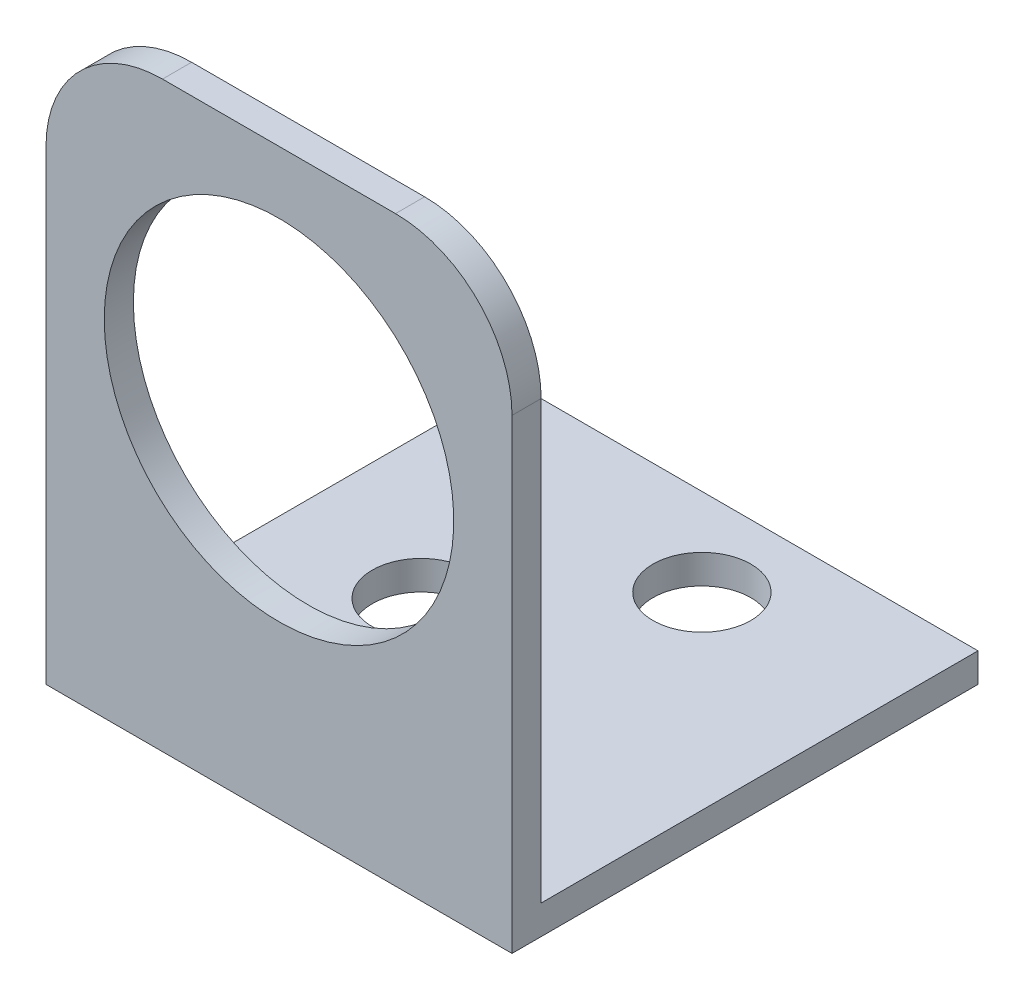
ISO-10303-21;
HEADER;
FILE_DESCRIPTION(('STEP AP214'),'2;1');
FILE_NAME('part.step','',(''),(''),'','','');
FILE_SCHEMA(('AUTOMOTIVE_DESIGN { 1 0 10303 214 1 1 1 1 }'));
ENDSEC;
DATA;
#1=APPLICATION_CONTEXT('core data for automotive mechanical design processes');
#2=APPLICATION_PROTOCOL_DEFINITION('international standard','automotive_design',2000,#1);
#3=PRODUCT_CONTEXT('',#1,'mechanical');
#4=PRODUCT('Part','Part','',(#3));
#5=PRODUCT_RELATED_PRODUCT_CATEGORY('part','',(#4));
#6=PRODUCT_DEFINITION_FORMATION('','',#4);
#7=PRODUCT_DEFINITION_CONTEXT('part definition',#1,'design');
#8=PRODUCT_DEFINITION('design','',#6,#7);
#9=PRODUCT_DEFINITION_SHAPE('','',#8);
#10=(LENGTH_UNIT() NAMED_UNIT(*) SI_UNIT(.MILLI.,.METRE.));
#11=(NAMED_UNIT(*) PLANE_ANGLE_UNIT() SI_UNIT($,.RADIAN.));
#12=(NAMED_UNIT(*) SI_UNIT($,.STERADIAN.) SOLID_ANGLE_UNIT());
#13=UNCERTAINTY_MEASURE_WITH_UNIT(LENGTH_MEASURE(1.E-05),#10,'distance_accuracy_value','');
#14=(GEOMETRIC_REPRESENTATION_CONTEXT(3) GLOBAL_UNCERTAINTY_ASSIGNED_CONTEXT((#13)) GLOBAL_UNIT_ASSIGNED_CONTEXT((#10,
#11,#12)) REPRESENTATION_CONTEXT('',''));
#15=CARTESIAN_POINT('',(0.,0.,0.));
#16=DIRECTION('',(0.,0.,1.));
#17=DIRECTION('',(1.,0.,0.));
#18=AXIS2_PLACEMENT_3D('',#15,#16,#17);
#19=CARTESIAN_POINT('',(25.4,0.,0.));
#20=DIRECTION('',(0.,0.,-1.));
#21=DIRECTION('',(-1.,0.,0.));
#22=AXIS2_PLACEMENT_3D('',#19,#20,#21);
#23=PLANE('',#22);
#24=CARTESIAN_POINT('',(12.7,18.8307473564399,0.));
#25=DIRECTION('',(0.,0.,-1.));
#26=DIRECTION('',(-1.,0.,0.));
#27=AXIS2_PLACEMENT_3D('',#24,#25,#26);
#28=CIRCLE('',#27,9.525);
#29=CARTESIAN_POINT('',(3.175,18.8307473564399,0.));
#30=VERTEX_POINT('',#29);
#31=EDGE_CURVE('E177',#30,#30,#28,.F.);
#32=ORIENTED_EDGE('',*,*,#31,.F.);
#33=EDGE_LOOP('',(#32));
#34=FACE_BOUND('',#33,.T.);
#35=DIRECTION('',(0.,-1.,0.));
#36=VECTOR('',#35,1.);
#37=CARTESIAN_POINT('',(25.4,0.,0.));
#38=LINE('',#37,#36);
#39=CARTESIAN_POINT('',(25.4,25.4,0.));
#40=VERTEX_POINT('',#39);
#41=CARTESIAN_POINT('',(25.4,0.,0.));
#42=VERTEX_POINT('',#41);
#43=EDGE_CURVE('E100',#40,#42,#38,.T.);
#44=ORIENTED_EDGE('',*,*,#43,.F.);
#45=CARTESIAN_POINT('',(19.05,25.4,0.));
#46=DIRECTION('',(0.,0.,-1.));
#47=DIRECTION('',(-1.,0.,0.));
#48=AXIS2_PLACEMENT_3D('',#45,#46,#47);
#49=CIRCLE('',#48,6.35);
#50=CARTESIAN_POINT('',(19.05,31.75,0.));
#51=VERTEX_POINT('',#50);
#52=EDGE_CURVE('E131',#40,#51,#49,.F.);
#53=ORIENTED_EDGE('',*,*,#52,.T.);
#54=DIRECTION('',(-1.,0.,0.));
#55=VECTOR('',#54,1.);
#56=CARTESIAN_POINT('',(25.4,31.75,0.));
#57=LINE('',#56,#55);
#58=CARTESIAN_POINT('',(6.35,31.75,0.));
#59=VERTEX_POINT('',#58);
#60=EDGE_CURVE('E149',#51,#59,#57,.T.);
#61=ORIENTED_EDGE('',*,*,#60,.T.);
#62=CARTESIAN_POINT('',(6.35,25.4,0.));
#63=DIRECTION('',(0.,0.,-1.));
#64=DIRECTION('',(-1.,0.,0.));
#65=AXIS2_PLACEMENT_3D('',#62,#63,#64);
#66=CIRCLE('',#65,6.35);
#67=CARTESIAN_POINT('',(0.,25.4,0.));
#68=VERTEX_POINT('',#67);
#69=EDGE_CURVE('E124',#59,#68,#66,.F.);
#70=ORIENTED_EDGE('',*,*,#69,.T.);
#71=DIRECTION('',(0.,-1.,0.));
#72=VECTOR('',#71,1.);
#73=CARTESIAN_POINT('',(0.,0.,0.));
#74=LINE('',#73,#72);
#75=CARTESIAN_POINT('',(0.,0.,0.));
#76=VERTEX_POINT('',#75);
#77=EDGE_CURVE('E121',#68,#76,#74,.T.);
#78=ORIENTED_EDGE('',*,*,#77,.T.);
#79=DIRECTION('',(-1.,0.,0.));
#80=VECTOR('',#79,1.);
#81=CARTESIAN_POINT('',(25.4,0.,0.));
#82=LINE('',#81,#80);
#83=EDGE_CURVE('E115',#42,#76,#82,.T.);
#84=ORIENTED_EDGE('',*,*,#83,.F.);
#85=EDGE_LOOP('',(#44,#53,#61,#70,#78,#84));
#86=FACE_BOUND('',#85,.T.);
#87=ADVANCED_FACE('F34',(#34,#86),#23,.F.);
#88=CARTESIAN_POINT('',(25.4,0.,0.));
#89=DIRECTION('',(0.,1.,0.));
#90=DIRECTION('',(0.,0.,1.));
#91=AXIS2_PLACEMENT_3D('',#88,#89,#90);
#92=PLANE('',#91);
#93=CARTESIAN_POINT('',(15.1130000000052,0.,-20.6375));
#94=DIRECTION('',(0.,-1.,0.));
#95=DIRECTION('',(0.,0.,-1.));
#96=AXIS2_PLACEMENT_3D('',#93,#94,#95);
#97=CIRCLE('',#96,2.667);
#98=CARTESIAN_POINT('',(15.1130000000052,0.,-23.3045));
#99=VERTEX_POINT('',#98);
#100=EDGE_CURVE('E190',#99,#99,#97,.T.);
#101=ORIENTED_EDGE('',*,*,#100,.F.);
#102=EDGE_LOOP('',(#101));
#103=FACE_BOUND('',#102,.T.);
#104=CARTESIAN_POINT('',(7.74700000000395,0.,-12.7));
#105=DIRECTION('',(0.,-1.,0.));
#106=DIRECTION('',(0.,0.,-1.));
#107=AXIS2_PLACEMENT_3D('',#104,#105,#106);
#108=CIRCLE('',#107,2.667);
#109=CARTESIAN_POINT('',(7.74700000000395,0.,-15.367));
#110=VERTEX_POINT('',#109);
#111=EDGE_CURVE('E191',#110,#110,#108,.T.);
#112=ORIENTED_EDGE('',*,*,#111,.F.);
#113=EDGE_LOOP('',(#112));
#114=FACE_BOUND('',#113,.T.);
#115=DIRECTION('',(0.,0.,-1.));
#116=VECTOR('',#115,1.);
#117=CARTESIAN_POINT('',(0.,0.,0.));
#118=LINE('',#117,#116);
#119=CARTESIAN_POINT('',(0.,0.,-25.4));
#120=VERTEX_POINT('',#119);
#121=EDGE_CURVE('E173',#76,#120,#118,.T.);
#122=ORIENTED_EDGE('',*,*,#121,.T.);
#123=DIRECTION('',(-1.,0.,0.));
#124=VECTOR('',#123,1.);
#125=CARTESIAN_POINT('',(25.4,0.,-25.4));
#126=LINE('',#125,#124);
#127=CARTESIAN_POINT('',(25.4,0.,-25.4));
#128=VERTEX_POINT('',#127);
#129=EDGE_CURVE('E117',#128,#120,#126,.T.);
#130=ORIENTED_EDGE('',*,*,#129,.F.);
#131=DIRECTION('',(0.,0.,-1.));
#132=VECTOR('',#131,1.);
#133=CARTESIAN_POINT('',(25.4,0.,0.));
#134=LINE('',#133,#132);
#135=EDGE_CURVE('E104',#42,#128,#134,.T.);
#136=ORIENTED_EDGE('',*,*,#135,.F.);
#137=ORIENTED_EDGE('',*,*,#83,.T.);
#138=EDGE_LOOP('',(#122,#130,#136,#137));
#139=FACE_BOUND('',#138,.T.);
#140=ADVANCED_FACE('F114',(#103,#114,#139),#92,.F.);
#141=CARTESIAN_POINT('',(25.4,0.,-25.4));
#142=DIRECTION('',(0.,0.,1.));
#143=DIRECTION('',(1.,0.,0.));
#144=AXIS2_PLACEMENT_3D('',#141,#142,#143);
#145=PLANE('',#144);
#146=DIRECTION('',(0.,1.,0.));
#147=VECTOR('',#146,1.);
#148=CARTESIAN_POINT('',(0.,0.,-25.4));
#149=LINE('',#148,#147);
#150=CARTESIAN_POINT('',(0.,1.5875,-25.4));
#151=VERTEX_POINT('',#150);
#152=EDGE_CURVE('E172',#120,#151,#149,.T.);
#153=ORIENTED_EDGE('',*,*,#152,.T.);
#154=DIRECTION('',(-1.,0.,0.));
#155=VECTOR('',#154,1.);
#156=CARTESIAN_POINT('',(25.4,1.5875,-25.4));
#157=LINE('',#156,#155);
#158=CARTESIAN_POINT('',(25.4,1.5875,-25.4));
#159=VERTEX_POINT('',#158);
#160=EDGE_CURVE('E126',#159,#151,#157,.T.);
#161=ORIENTED_EDGE('',*,*,#160,.F.);
#162=DIRECTION('',(0.,1.,0.));
#163=VECTOR('',#162,1.);
#164=CARTESIAN_POINT('',(25.4,0.,-25.4));
#165=LINE('',#164,#163);
#166=EDGE_CURVE('E119',#128,#159,#165,.T.);
#167=ORIENTED_EDGE('',*,*,#166,.F.);
#168=ORIENTED_EDGE('',*,*,#129,.T.);
#169=EDGE_LOOP('',(#153,#161,#167,#168));
#170=FACE_BOUND('',#169,.T.);
#171=ADVANCED_FACE('F204',(#170),#145,.F.);
#172=CARTESIAN_POINT('',(25.4,1.5875,-1.5875));
#173=DIRECTION('',(0.,-1.,0.));
#174=DIRECTION('',(0.,0.,-1.));
#175=AXIS2_PLACEMENT_3D('',#172,#173,#174);
#176=PLANE('',#175);
#177=CARTESIAN_POINT('',(15.1130000000052,1.5875,-20.6375));
#178=DIRECTION('',(0.,-1.,0.));
#179=DIRECTION('',(0.,0.,-1.));
#180=AXIS2_PLACEMENT_3D('',#177,#178,#179);
#181=CIRCLE('',#180,2.667);
#182=CARTESIAN_POINT('',(15.1130000000052,1.5875,-23.3045));
#183=VERTEX_POINT('',#182);
#184=EDGE_CURVE('E186',#183,#183,#181,.F.);
#185=ORIENTED_EDGE('',*,*,#184,.F.);
#186=EDGE_LOOP('',(#185));
#187=FACE_BOUND('',#186,.T.);
#188=CARTESIAN_POINT('',(7.74700000000395,1.5875,-12.7));
#189=DIRECTION('',(0.,-1.,0.));
#190=DIRECTION('',(0.,0.,-1.));
#191=AXIS2_PLACEMENT_3D('',#188,#189,#190);
#192=CIRCLE('',#191,2.667);
#193=CARTESIAN_POINT('',(7.74700000000395,1.5875,-15.367));
#194=VERTEX_POINT('',#193);
#195=EDGE_CURVE('E187',#194,#194,#192,.F.);
#196=ORIENTED_EDGE('',*,*,#195,.F.);
#197=EDGE_LOOP('',(#196));
#198=FACE_BOUND('',#197,.T.);
#199=DIRECTION('',(0.,0.,1.));
#200=VECTOR('',#199,1.);
#201=CARTESIAN_POINT('',(0.,1.5875,-1.5875));
#202=LINE('',#201,#200);
#203=CARTESIAN_POINT('',(0.,1.5875,-1.5875));
#204=VERTEX_POINT('',#203);
#205=EDGE_CURVE('E168',#151,#204,#202,.T.);
#206=ORIENTED_EDGE('',*,*,#205,.T.);
#207=DIRECTION('',(-1.,0.,0.));
#208=VECTOR('',#207,1.);
#209=CARTESIAN_POINT('',(25.4,1.5875,-1.5875));
#210=LINE('',#209,#208);
#211=CARTESIAN_POINT('',(25.4,1.5875,-1.5875));
#212=VERTEX_POINT('',#211);
#213=EDGE_CURVE('E158',#212,#204,#210,.T.);
#214=ORIENTED_EDGE('',*,*,#213,.F.);
#215=DIRECTION('',(0.,0.,1.));
#216=VECTOR('',#215,1.);
#217=CARTESIAN_POINT('',(25.4,1.5875,-1.5875));
#218=LINE('',#217,#216);
#219=EDGE_CURVE('E147',#159,#212,#218,.T.);
#220=ORIENTED_EDGE('',*,*,#219,.F.);
#221=ORIENTED_EDGE('',*,*,#160,.T.);
#222=EDGE_LOOP('',(#206,#214,#220,#221));
#223=FACE_BOUND('',#222,.T.);
#224=ADVANCED_FACE('F167',(#187,#198,#223),#176,.F.);
#225=CARTESIAN_POINT('',(25.4,1.5875,-1.5875));
#226=DIRECTION('',(0.,0.,1.));
#227=DIRECTION('',(1.,0.,0.));
#228=AXIS2_PLACEMENT_3D('',#225,#226,#227);
#229=PLANE('',#228);
#230=CARTESIAN_POINT('',(12.7,18.8307473564399,-1.5875));
#231=DIRECTION('',(0.,0.,-1.));
#232=DIRECTION('',(-1.,0.,0.));
#233=AXIS2_PLACEMENT_3D('',#230,#231,#232);
#234=CIRCLE('',#233,9.525);
#235=CARTESIAN_POINT('',(3.175,18.8307473564399,-1.5875));
#236=VERTEX_POINT('',#235);
#237=EDGE_CURVE('E183',#236,#236,#234,.T.);
#238=ORIENTED_EDGE('',*,*,#237,.F.);
#239=EDGE_LOOP('',(#238));
#240=FACE_BOUND('',#239,.T.);
#241=DIRECTION('',(-1.,0.,0.));
#242=VECTOR('',#241,1.);
#243=CARTESIAN_POINT('',(25.4,31.75,-1.5875));
#244=LINE('',#243,#242);
#245=CARTESIAN_POINT('',(19.05,31.75,-1.5875));
#246=VERTEX_POINT('',#245);
#247=CARTESIAN_POINT('',(6.35,31.75,-1.5875));
#248=VERTEX_POINT('',#247);
#249=EDGE_CURVE('E143',#246,#248,#244,.T.);
#250=ORIENTED_EDGE('',*,*,#249,.F.);
#251=CARTESIAN_POINT('',(19.05,25.4,-1.5875));
#252=DIRECTION('',(0.,0.,1.));
#253=DIRECTION('',(1.,0.,0.));
#254=AXIS2_PLACEMENT_3D('',#251,#252,#253);
#255=CIRCLE('',#254,6.35);
#256=CARTESIAN_POINT('',(25.4,25.4,-1.5875));
#257=VERTEX_POINT('',#256);
#258=EDGE_CURVE('E42',#246,#257,#255,.F.);
#259=ORIENTED_EDGE('',*,*,#258,.T.);
#260=DIRECTION('',(0.,1.,0.));
#261=VECTOR('',#260,1.);
#262=CARTESIAN_POINT('',(25.4,1.5875,-1.5875));
#263=LINE('',#262,#261);
#264=EDGE_CURVE('E142',#212,#257,#263,.T.);
#265=ORIENTED_EDGE('',*,*,#264,.F.);
#266=ORIENTED_EDGE('',*,*,#213,.T.);
#267=DIRECTION('',(0.,1.,0.));
#268=VECTOR('',#267,1.);
#269=CARTESIAN_POINT('',(0.,1.5875,-1.5875));
#270=LINE('',#269,#268);
#271=CARTESIAN_POINT('',(0.,25.4,-1.5875));
#272=VERTEX_POINT('',#271);
#273=EDGE_CURVE('E110',#204,#272,#270,.T.);
#274=ORIENTED_EDGE('',*,*,#273,.T.);
#275=CARTESIAN_POINT('',(6.35,25.4,-1.5875));
#276=DIRECTION('',(0.,0.,1.));
#277=DIRECTION('',(1.,0.,0.));
#278=AXIS2_PLACEMENT_3D('',#275,#276,#277);
#279=CIRCLE('',#278,6.35);
#280=EDGE_CURVE('E54',#272,#248,#279,.F.);
#281=ORIENTED_EDGE('',*,*,#280,.T.);
#282=EDGE_LOOP('',(#250,#259,#265,#266,#274,#281));
#283=FACE_BOUND('',#282,.T.);
#284=ADVANCED_FACE('F140',(#240,#283),#229,.F.);
#285=CARTESIAN_POINT('',(25.4,31.75,0.));
#286=DIRECTION('',(0.,-1.,0.));
#287=DIRECTION('',(0.,0.,-1.));
#288=AXIS2_PLACEMENT_3D('',#285,#286,#287);
#289=PLANE('',#288);
#290=ORIENTED_EDGE('',*,*,#60,.F.);
#291=DIRECTION('',(0.,0.,1.));
#292=VECTOR('',#291,1.);
#293=CARTESIAN_POINT('',(19.05,31.75,0.));
#294=LINE('',#293,#292);
#295=EDGE_CURVE('E136',#51,#246,#294,.F.);
#296=ORIENTED_EDGE('',*,*,#295,.T.);
#297=ORIENTED_EDGE('',*,*,#249,.T.);
#298=DIRECTION('',(0.,0.,1.));
#299=VECTOR('',#298,1.);
#300=CARTESIAN_POINT('',(6.35,31.75,0.));
#301=LINE('',#300,#299);
#302=EDGE_CURVE('E133',#248,#59,#301,.T.);
#303=ORIENTED_EDGE('',*,*,#302,.T.);
#304=EDGE_LOOP('',(#290,#296,#297,#303));
#305=FACE_BOUND('',#304,.T.);
#306=ADVANCED_FACE('F155',(#305),#289,.F.);
#307=CARTESIAN_POINT('',(25.4,0.,0.));
#308=DIRECTION('',(-1.,0.,0.));
#309=DIRECTION('',(0.,0.,1.));
#310=AXIS2_PLACEMENT_3D('',#307,#308,#309);
#311=PLANE('',#310);
#312=ORIENTED_EDGE('',*,*,#264,.T.);
#313=DIRECTION('',(0.,0.,1.));
#314=VECTOR('',#313,1.);
#315=CARTESIAN_POINT('',(25.4,25.4,0.));
#316=LINE('',#315,#314);
#317=EDGE_CURVE('E107',#257,#40,#316,.T.);
#318=ORIENTED_EDGE('',*,*,#317,.T.);
#319=ORIENTED_EDGE('',*,*,#43,.T.);
#320=ORIENTED_EDGE('',*,*,#135,.T.);
#321=ORIENTED_EDGE('',*,*,#166,.T.);
#322=ORIENTED_EDGE('',*,*,#219,.T.);
#323=EDGE_LOOP('',(#312,#318,#319,#320,#321,#322));
#324=FACE_BOUND('',#323,.T.);
#325=ADVANCED_FACE('F103',(#324),#311,.F.);
#326=CARTESIAN_POINT('',(0.,0.,0.));
#327=DIRECTION('',(-1.,0.,0.));
#328=DIRECTION('',(0.,0.,1.));
#329=AXIS2_PLACEMENT_3D('',#326,#327,#328);
#330=PLANE('',#329);
#331=ORIENTED_EDGE('',*,*,#77,.F.);
#332=DIRECTION('',(0.,0.,1.));
#333=VECTOR('',#332,1.);
#334=CARTESIAN_POINT('',(0.,25.4,-1.5875));
#335=LINE('',#334,#333);
#336=EDGE_CURVE('E11',#68,#272,#335,.F.);
#337=ORIENTED_EDGE('',*,*,#336,.T.);
#338=ORIENTED_EDGE('',*,*,#273,.F.);
#339=ORIENTED_EDGE('',*,*,#205,.F.);
#340=ORIENTED_EDGE('',*,*,#152,.F.);
#341=ORIENTED_EDGE('',*,*,#121,.F.);
#342=EDGE_LOOP('',(#331,#337,#338,#339,#340,#341));
#343=FACE_BOUND('',#342,.T.);
#344=ADVANCED_FACE('F171',(#343),#330,.T.);
#345=CARTESIAN_POINT('',(12.7,18.8307473564399,0.000999999999999916));
#346=DIRECTION('',(0.,0.,-1.));
#347=DIRECTION('',(-1.,0.,0.));
#348=AXIS2_PLACEMENT_3D('',#345,#346,#347);
#349=CYLINDRICAL_SURFACE('',#348,9.525);
#350=ORIENTED_EDGE('',*,*,#237,.T.);
#351=EDGE_LOOP('',(#350));
#352=FACE_BOUND('',#351,.T.);
#353=ORIENTED_EDGE('',*,*,#31,.T.);
#354=EDGE_LOOP('',(#353));
#355=FACE_BOUND('',#354,.T.);
#356=ADVANCED_FACE('F232',(#352,#355),#349,.F.);
#357=CARTESIAN_POINT('',(19.05,25.4,0.));
#358=DIRECTION('',(0.,0.,1.));
#359=DIRECTION('',(1.,0.,0.));
#360=AXIS2_PLACEMENT_3D('',#357,#358,#359);
#361=CYLINDRICAL_SURFACE('',#360,6.35);
#362=ORIENTED_EDGE('',*,*,#258,.F.);
#363=ORIENTED_EDGE('',*,*,#295,.F.);
#364=ORIENTED_EDGE('',*,*,#52,.F.);
#365=ORIENTED_EDGE('',*,*,#317,.F.);
#366=EDGE_LOOP('',(#362,#363,#364,#365));
#367=FACE_BOUND('',#366,.T.);
#368=ADVANCED_FACE('F151',(#367),#361,.T.);
#369=CARTESIAN_POINT('',(6.35,25.4,0.));
#370=DIRECTION('',(0.,0.,-1.));
#371=DIRECTION('',(-1.,0.,0.));
#372=AXIS2_PLACEMENT_3D('',#369,#370,#371);
#373=CYLINDRICAL_SURFACE('',#372,6.35);
#374=ORIENTED_EDGE('',*,*,#280,.F.);
#375=ORIENTED_EDGE('',*,*,#336,.F.);
#376=ORIENTED_EDGE('',*,*,#69,.F.);
#377=ORIENTED_EDGE('',*,*,#302,.F.);
#378=EDGE_LOOP('',(#374,#375,#376,#377));
#379=FACE_BOUND('',#378,.T.);
#380=ADVANCED_FACE('F36',(#379),#373,.T.);
#381=CARTESIAN_POINT('',(7.74700000000395,31.751,-12.7));
#382=DIRECTION('',(0.,-1.,0.));
#383=DIRECTION('',(0.,0.,-1.));
#384=AXIS2_PLACEMENT_3D('',#381,#382,#383);
#385=CYLINDRICAL_SURFACE('',#384,2.667);
#386=ORIENTED_EDGE('',*,*,#111,.T.);
#387=EDGE_LOOP('',(#386));
#388=FACE_BOUND('',#387,.T.);
#389=ORIENTED_EDGE('',*,*,#195,.T.);
#390=EDGE_LOOP('',(#389));
#391=FACE_BOUND('',#390,.T.);
#392=ADVANCED_FACE('F208',(#388,#391),#385,.F.);
#393=CARTESIAN_POINT('',(15.1130000000052,31.751,-20.6375));
#394=DIRECTION('',(0.,-1.,0.));
#395=DIRECTION('',(0.,0.,-1.));
#396=AXIS2_PLACEMENT_3D('',#393,#394,#395);
#397=CYLINDRICAL_SURFACE('',#396,2.667);
#398=ORIENTED_EDGE('',*,*,#100,.T.);
#399=EDGE_LOOP('',(#398));
#400=FACE_BOUND('',#399,.T.);
#401=ORIENTED_EDGE('',*,*,#184,.T.);
#402=EDGE_LOOP('',(#401));
#403=FACE_BOUND('',#402,.T.);
#404=ADVANCED_FACE('F199',(#400,#403),#397,.F.);
#405=CLOSED_SHELL('',(#87,#140,#171,#224,#284,#306,#325,#344,#356,#368,#380,#392,#404));
#406=MANIFOLD_SOLID_BREP('B2',#405);
#407=ADVANCED_BREP_SHAPE_REPRESENTATION('',(#18,#406),#14);
#408=SHAPE_DEFINITION_REPRESENTATION(#9,#407);
ENDSEC;
END-ISO-10303-21;
